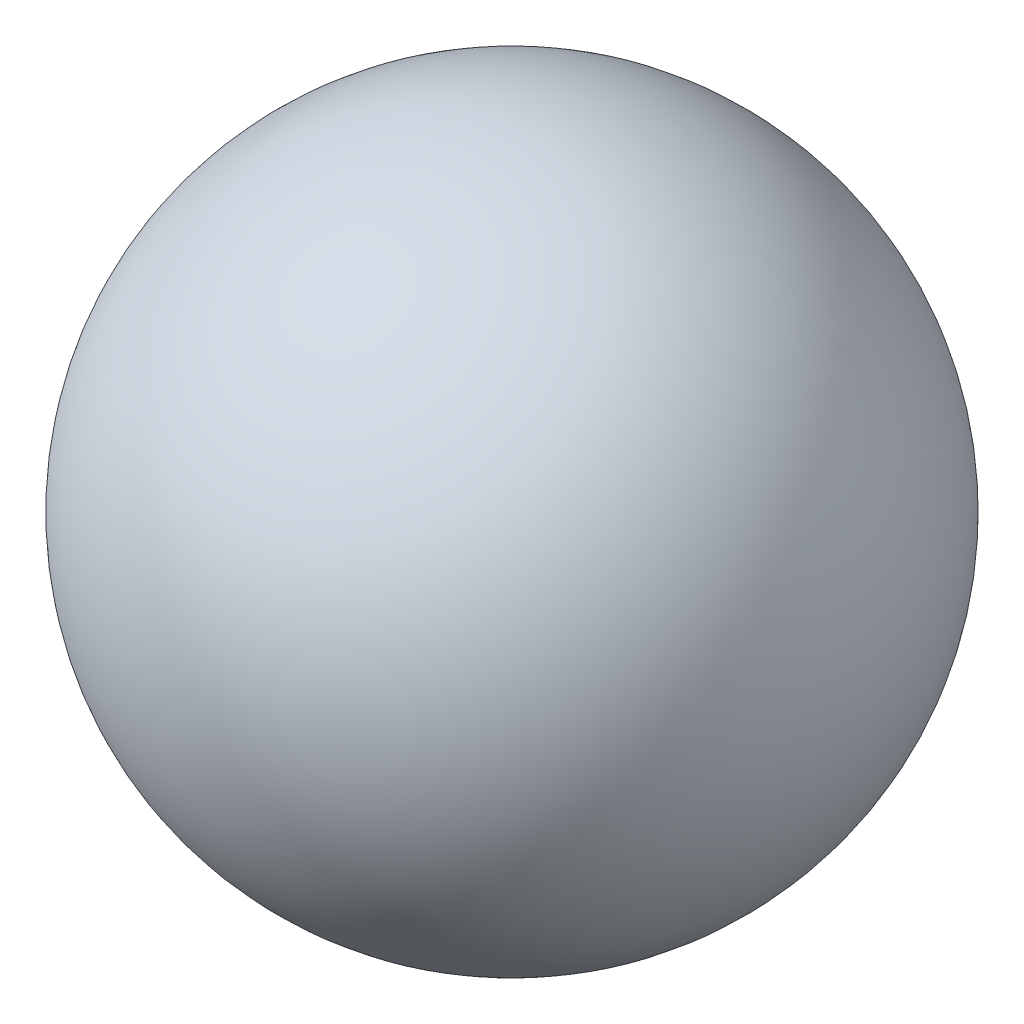
ISO-10303-21;
HEADER;
FILE_DESCRIPTION(('STEP AP214'),'2;1');
FILE_NAME('part.step','',(''),(''),'','','');
FILE_SCHEMA(('AUTOMOTIVE_DESIGN { 1 0 10303 214 1 1 1 1 }'));
ENDSEC;
DATA;
#1=APPLICATION_CONTEXT('core data for automotive mechanical design processes');
#2=APPLICATION_PROTOCOL_DEFINITION('international standard','automotive_design',2000,#1);
#3=PRODUCT_CONTEXT('',#1,'mechanical');
#4=PRODUCT('Part','Part','',(#3));
#5=PRODUCT_RELATED_PRODUCT_CATEGORY('part','',(#4));
#6=PRODUCT_DEFINITION_FORMATION('','',#4);
#7=PRODUCT_DEFINITION_CONTEXT('part definition',#1,'design');
#8=PRODUCT_DEFINITION('design','',#6,#7);
#9=PRODUCT_DEFINITION_SHAPE('','',#8);
#10=(LENGTH_UNIT() NAMED_UNIT(*) SI_UNIT(.MILLI.,.METRE.));
#11=(NAMED_UNIT(*) PLANE_ANGLE_UNIT() SI_UNIT($,.RADIAN.));
#12=(NAMED_UNIT(*) SI_UNIT($,.STERADIAN.) SOLID_ANGLE_UNIT());
#13=UNCERTAINTY_MEASURE_WITH_UNIT(LENGTH_MEASURE(1.E-05),#10,'distance_accuracy_value','');
#14=(GEOMETRIC_REPRESENTATION_CONTEXT(3) GLOBAL_UNCERTAINTY_ASSIGNED_CONTEXT((#13)) GLOBAL_UNIT_ASSIGNED_CONTEXT((#10,
#11,#12)) REPRESENTATION_CONTEXT('',''));
#15=CARTESIAN_POINT('',(0.,0.,0.));
#16=DIRECTION('',(0.,0.,1.));
#17=DIRECTION('',(1.,0.,0.));
#18=AXIS2_PLACEMENT_3D('',#15,#16,#17);
#19=CARTESIAN_POINT('',(0.,0.,0.));
#20=DIRECTION('',(0.,-1.,0.));
#21=DIRECTION('',(-1.,0.,0.));
#22=AXIS2_PLACEMENT_3D('',#19,#20,#21);
#23=SPHERICAL_SURFACE('',#22,7.);
#24=CARTESIAN_POINT('',(0.,-7.,0.));
#25=VERTEX_POINT('',#24);
#26=VERTEX_LOOP('',#25);
#27=FACE_BOUND('',#26,.T.);
#28=ADVANCED_FACE('F29',(#27),#23,.T.);
#29=CLOSED_SHELL('',(#28));
#30=MANIFOLD_SOLID_BREP('B2',#29);
#31=ADVANCED_BREP_SHAPE_REPRESENTATION('',(#18,#30),#14);
#32=SHAPE_DEFINITION_REPRESENTATION(#9,#31);
ENDSEC;
END-ISO-10303-21;
